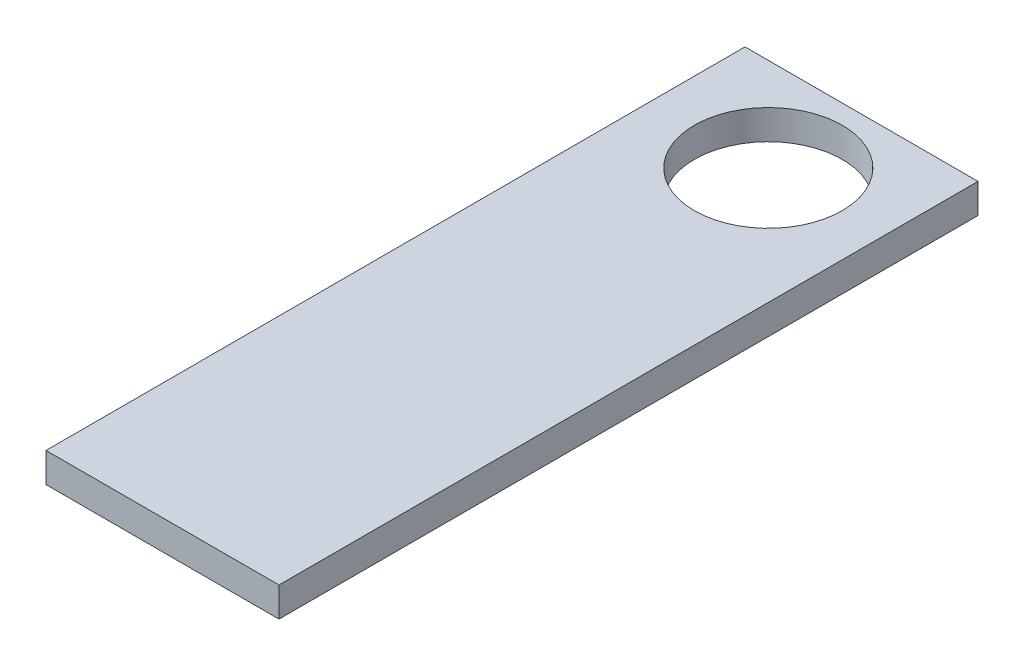
ISO-10303-21;
HEADER;
FILE_DESCRIPTION(('STEP AP214'),'2;1');
FILE_NAME('part.step','',(''),(''),'','','');
FILE_SCHEMA(('AUTOMOTIVE_DESIGN { 1 0 10303 214 1 1 1 1 }'));
ENDSEC;
DATA;
#1=APPLICATION_CONTEXT('core data for automotive mechanical design processes');
#2=APPLICATION_PROTOCOL_DEFINITION('international standard','automotive_design',2000,#1);
#3=PRODUCT_CONTEXT('',#1,'mechanical');
#4=PRODUCT('Part','Part','',(#3));
#5=PRODUCT_RELATED_PRODUCT_CATEGORY('part','',(#4));
#6=PRODUCT_DEFINITION_FORMATION('','',#4);
#7=PRODUCT_DEFINITION_CONTEXT('part definition',#1,'design');
#8=PRODUCT_DEFINITION('design','',#6,#7);
#9=PRODUCT_DEFINITION_SHAPE('','',#8);
#10=(LENGTH_UNIT() NAMED_UNIT(*) SI_UNIT(.MILLI.,.METRE.));
#11=(NAMED_UNIT(*) PLANE_ANGLE_UNIT() SI_UNIT($,.RADIAN.));
#12=(NAMED_UNIT(*) SI_UNIT($,.STERADIAN.) SOLID_ANGLE_UNIT());
#13=UNCERTAINTY_MEASURE_WITH_UNIT(LENGTH_MEASURE(1.E-05),#10,'distance_accuracy_value','');
#14=(GEOMETRIC_REPRESENTATION_CONTEXT(3) GLOBAL_UNCERTAINTY_ASSIGNED_CONTEXT((#13)) GLOBAL_UNIT_ASSIGNED_CONTEXT((#10,
#11,#12)) REPRESENTATION_CONTEXT('',''));
#15=CARTESIAN_POINT('',(0.,0.,0.));
#16=DIRECTION('',(0.,0.,1.));
#17=DIRECTION('',(1.,0.,0.));
#18=AXIS2_PLACEMENT_3D('',#15,#16,#17);
#19=CARTESIAN_POINT('',(0.,1.27,0.));
#20=DIRECTION('',(0.,1.,0.));
#21=DIRECTION('',(0.,0.,1.));
#22=AXIS2_PLACEMENT_3D('',#19,#20,#21);
#23=PLANE('',#22);
#24=DIRECTION('',(0.,0.,1.));
#25=VECTOR('',#24,1.);
#26=CARTESIAN_POINT('',(0.,1.27,0.));
#27=LINE('',#26,#25);
#28=CARTESIAN_POINT('',(0.,1.27,0.));
#29=VERTEX_POINT('',#28);
#30=CARTESIAN_POINT('',(0.,1.27,30.));
#31=VERTEX_POINT('',#30);
#32=EDGE_CURVE('E87',#29,#31,#27,.T.);
#33=ORIENTED_EDGE('',*,*,#32,.T.);
#34=DIRECTION('',(1.,0.,0.));
#35=VECTOR('',#34,1.);
#36=CARTESIAN_POINT('',(0.,1.27,30.));
#37=LINE('',#36,#35);
#38=CARTESIAN_POINT('',(10.,1.27,30.));
#39=VERTEX_POINT('',#38);
#40=EDGE_CURVE('E82',#31,#39,#37,.T.);
#41=ORIENTED_EDGE('',*,*,#40,.T.);
#42=DIRECTION('',(0.,0.,-1.));
#43=VECTOR('',#42,1.);
#44=CARTESIAN_POINT('',(9.99999999999999,1.27,0.));
#45=LINE('',#44,#43);
#46=CARTESIAN_POINT('',(9.99999999999999,1.27,0.));
#47=VERTEX_POINT('',#46);
#48=EDGE_CURVE('E85',#39,#47,#45,.T.);
#49=ORIENTED_EDGE('',*,*,#48,.T.);
#50=DIRECTION('',(-1.,0.,0.));
#51=VECTOR('',#50,1.);
#52=CARTESIAN_POINT('',(0.,1.27,0.));
#53=LINE('',#52,#51);
#54=EDGE_CURVE('E52',#47,#29,#53,.T.);
#55=ORIENTED_EDGE('',*,*,#54,.T.);
#56=EDGE_LOOP('',(#33,#41,#49,#55));
#57=FACE_BOUND('',#56,.T.);
#58=CARTESIAN_POINT('',(5.,1.27,4.));
#59=DIRECTION('',(0.,1.,0.));
#60=DIRECTION('',(0.,0.,1.));
#61=AXIS2_PLACEMENT_3D('',#58,#59,#60);
#62=CIRCLE('',#61,3.175);
#63=CARTESIAN_POINT('',(5.,1.27,7.175));
#64=VERTEX_POINT('',#63);
#65=EDGE_CURVE('E102',#64,#64,#62,.T.);
#66=ORIENTED_EDGE('',*,*,#65,.F.);
#67=EDGE_LOOP('',(#66));
#68=FACE_BOUND('',#67,.T.);
#69=ADVANCED_FACE('F35',(#57,#68),#23,.T.);
#70=CARTESIAN_POINT('',(0.,0.,0.));
#71=DIRECTION('',(0.,1.,0.));
#72=DIRECTION('',(0.,0.,1.));
#73=AXIS2_PLACEMENT_3D('',#70,#71,#72);
#74=PLANE('',#73);
#75=DIRECTION('',(0.,0.,1.));
#76=VECTOR('',#75,1.);
#77=CARTESIAN_POINT('',(0.,0.,0.));
#78=LINE('',#77,#76);
#79=CARTESIAN_POINT('',(0.,0.,0.));
#80=VERTEX_POINT('',#79);
#81=CARTESIAN_POINT('',(0.,0.,30.));
#82=VERTEX_POINT('',#81);
#83=EDGE_CURVE('E99',#80,#82,#78,.T.);
#84=ORIENTED_EDGE('',*,*,#83,.F.);
#85=DIRECTION('',(-1.,0.,0.));
#86=VECTOR('',#85,1.);
#87=CARTESIAN_POINT('',(0.,0.,0.));
#88=LINE('',#87,#86);
#89=CARTESIAN_POINT('',(9.99999999999999,0.,0.));
#90=VERTEX_POINT('',#89);
#91=EDGE_CURVE('E75',#90,#80,#88,.T.);
#92=ORIENTED_EDGE('',*,*,#91,.F.);
#93=DIRECTION('',(0.,0.,-1.));
#94=VECTOR('',#93,1.);
#95=CARTESIAN_POINT('',(9.99999999999999,0.,0.));
#96=LINE('',#95,#94);
#97=CARTESIAN_POINT('',(10.,0.,30.));
#98=VERTEX_POINT('',#97);
#99=EDGE_CURVE('E69',#98,#90,#96,.T.);
#100=ORIENTED_EDGE('',*,*,#99,.F.);
#101=DIRECTION('',(1.,0.,0.));
#102=VECTOR('',#101,1.);
#103=CARTESIAN_POINT('',(0.,0.,30.));
#104=LINE('',#103,#102);
#105=EDGE_CURVE('E91',#82,#98,#104,.T.);
#106=ORIENTED_EDGE('',*,*,#105,.F.);
#107=EDGE_LOOP('',(#84,#92,#100,#106));
#108=FACE_BOUND('',#107,.T.);
#109=CARTESIAN_POINT('',(5.,0.,4.));
#110=DIRECTION('',(0.,1.,0.));
#111=DIRECTION('',(0.,0.,1.));
#112=AXIS2_PLACEMENT_3D('',#109,#110,#111);
#113=CIRCLE('',#112,3.175);
#114=CARTESIAN_POINT('',(5.,0.,7.175));
#115=VERTEX_POINT('',#114);
#116=EDGE_CURVE('E114',#115,#115,#113,.T.);
#117=ORIENTED_EDGE('',*,*,#116,.T.);
#118=EDGE_LOOP('',(#117));
#119=FACE_BOUND('',#118,.T.);
#120=ADVANCED_FACE('F110',(#108,#119),#74,.F.);
#121=CARTESIAN_POINT('',(0.,1.27,0.));
#122=DIRECTION('',(1.,0.,0.));
#123=DIRECTION('',(0.,0.,-1.));
#124=AXIS2_PLACEMENT_3D('',#121,#122,#123);
#125=PLANE('',#124);
#126=ORIENTED_EDGE('',*,*,#83,.T.);
#127=DIRECTION('',(0.,-1.,0.));
#128=VECTOR('',#127,1.);
#129=CARTESIAN_POINT('',(0.,1.27,30.));
#130=LINE('',#129,#128);
#131=EDGE_CURVE('E11',#31,#82,#130,.T.);
#132=ORIENTED_EDGE('',*,*,#131,.F.);
#133=ORIENTED_EDGE('',*,*,#32,.F.);
#134=DIRECTION('',(0.,-1.,0.));
#135=VECTOR('',#134,1.);
#136=CARTESIAN_POINT('',(0.,1.27,0.));
#137=LINE('',#136,#135);
#138=EDGE_CURVE('E95',#29,#80,#137,.T.);
#139=ORIENTED_EDGE('',*,*,#138,.T.);
#140=EDGE_LOOP('',(#126,#132,#133,#139));
#141=FACE_BOUND('',#140,.T.);
#142=ADVANCED_FACE('F37',(#141),#125,.F.);
#143=CARTESIAN_POINT('',(0.,1.27,30.));
#144=DIRECTION('',(0.,0.,-1.));
#145=DIRECTION('',(-1.,0.,0.));
#146=AXIS2_PLACEMENT_3D('',#143,#144,#145);
#147=PLANE('',#146);
#148=ORIENTED_EDGE('',*,*,#105,.T.);
#149=DIRECTION('',(0.,-1.,0.));
#150=VECTOR('',#149,1.);
#151=CARTESIAN_POINT('',(10.,1.27,30.));
#152=LINE('',#151,#150);
#153=EDGE_CURVE('E44',#39,#98,#152,.T.);
#154=ORIENTED_EDGE('',*,*,#153,.F.);
#155=ORIENTED_EDGE('',*,*,#40,.F.);
#156=ORIENTED_EDGE('',*,*,#131,.T.);
#157=EDGE_LOOP('',(#148,#154,#155,#156));
#158=FACE_BOUND('',#157,.T.);
#159=ADVANCED_FACE('F90',(#158),#147,.F.);
#160=CARTESIAN_POINT('',(9.99999999999999,1.27,0.));
#161=DIRECTION('',(-1.,0.,0.));
#162=DIRECTION('',(0.,0.,1.));
#163=AXIS2_PLACEMENT_3D('',#160,#161,#162);
#164=PLANE('',#163);
#165=ORIENTED_EDGE('',*,*,#99,.T.);
#166=DIRECTION('',(0.,-1.,0.));
#167=VECTOR('',#166,1.);
#168=CARTESIAN_POINT('',(9.99999999999999,1.27,0.));
#169=LINE('',#168,#167);
#170=EDGE_CURVE('E92',#47,#90,#169,.T.);
#171=ORIENTED_EDGE('',*,*,#170,.F.);
#172=ORIENTED_EDGE('',*,*,#48,.F.);
#173=ORIENTED_EDGE('',*,*,#153,.T.);
#174=EDGE_LOOP('',(#165,#171,#172,#173));
#175=FACE_BOUND('',#174,.T.);
#176=ADVANCED_FACE('F93',(#175),#164,.F.);
#177=CARTESIAN_POINT('',(0.,1.27,0.));
#178=DIRECTION('',(0.,0.,1.));
#179=DIRECTION('',(1.,0.,0.));
#180=AXIS2_PLACEMENT_3D('',#177,#178,#179);
#181=PLANE('',#180);
#182=ORIENTED_EDGE('',*,*,#91,.T.);
#183=ORIENTED_EDGE('',*,*,#138,.F.);
#184=ORIENTED_EDGE('',*,*,#54,.F.);
#185=ORIENTED_EDGE('',*,*,#170,.T.);
#186=EDGE_LOOP('',(#182,#183,#184,#185));
#187=FACE_BOUND('',#186,.T.);
#188=ADVANCED_FACE('F107',(#187),#181,.F.);
#189=CARTESIAN_POINT('',(5.,1.27,4.));
#190=DIRECTION('',(0.,-1.,0.));
#191=DIRECTION('',(0.,0.,-1.));
#192=AXIS2_PLACEMENT_3D('',#189,#190,#191);
#193=CYLINDRICAL_SURFACE('',#192,3.175);
#194=ORIENTED_EDGE('',*,*,#65,.T.);
#195=EDGE_LOOP('',(#194));
#196=FACE_BOUND('',#195,.T.);
#197=ORIENTED_EDGE('',*,*,#116,.F.);
#198=EDGE_LOOP('',(#197));
#199=FACE_BOUND('',#198,.T.);
#200=ADVANCED_FACE('F120',(#196,#199),#193,.F.);
#201=CLOSED_SHELL('',(#69,#120,#142,#159,#176,#188,#200));
#202=MANIFOLD_SOLID_BREP('B2',#201);
#203=ADVANCED_BREP_SHAPE_REPRESENTATION('',(#18,#202),#14);
#204=SHAPE_DEFINITION_REPRESENTATION(#9,#203);
ENDSEC;
END-ISO-10303-21;
